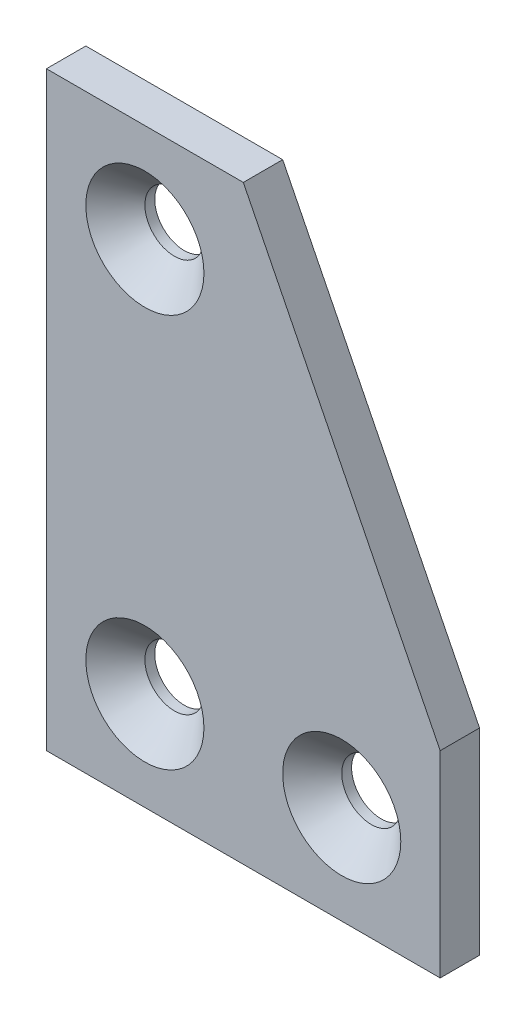
ISO-10303-21;
HEADER;
FILE_DESCRIPTION(('STEP AP214'),'2;1');
FILE_NAME('part.step','',(''),(''),'','','');
FILE_SCHEMA(('AUTOMOTIVE_DESIGN { 1 0 10303 214 1 1 1 1 }'));
ENDSEC;
DATA;
#1=APPLICATION_CONTEXT('core data for automotive mechanical design processes');
#2=APPLICATION_PROTOCOL_DEFINITION('international standard','automotive_design',2000,#1);
#3=PRODUCT_CONTEXT('',#1,'mechanical');
#4=PRODUCT('Part','Part','',(#3));
#5=PRODUCT_RELATED_PRODUCT_CATEGORY('part','',(#4));
#6=PRODUCT_DEFINITION_FORMATION('','',#4);
#7=PRODUCT_DEFINITION_CONTEXT('part definition',#1,'design');
#8=PRODUCT_DEFINITION('design','',#6,#7);
#9=PRODUCT_DEFINITION_SHAPE('','',#8);
#10=(LENGTH_UNIT() NAMED_UNIT(*) SI_UNIT(.MILLI.,.METRE.));
#11=(NAMED_UNIT(*) PLANE_ANGLE_UNIT() SI_UNIT($,.RADIAN.));
#12=(NAMED_UNIT(*) SI_UNIT($,.STERADIAN.) SOLID_ANGLE_UNIT());
#13=UNCERTAINTY_MEASURE_WITH_UNIT(LENGTH_MEASURE(1.E-05),#10,'distance_accuracy_value','');
#14=(GEOMETRIC_REPRESENTATION_CONTEXT(3) GLOBAL_UNCERTAINTY_ASSIGNED_CONTEXT((#13)) GLOBAL_UNIT_ASSIGNED_CONTEXT((#10,
#11,#12)) REPRESENTATION_CONTEXT('',''));
#15=CARTESIAN_POINT('',(0.,0.,0.));
#16=DIRECTION('',(0.,0.,1.));
#17=DIRECTION('',(1.,0.,0.));
#18=AXIS2_PLACEMENT_3D('',#15,#16,#17);
#19=CARTESIAN_POINT('',(0.,30.,2.));
#20=DIRECTION('',(-0.894427190999916,-0.447213595499958,0.));
#21=DIRECTION('',(0.447213595499958,-0.894427190999916,0.));
#22=AXIS2_PLACEMENT_3D('',#19,#20,#21);
#23=PLANE('',#22);
#24=DIRECTION('',(-0.447213595499958,0.894427190999916,0.));
#25=VECTOR('',#24,1.);
#26=CARTESIAN_POINT('',(0.,30.,-2.));
#27=LINE('',#26,#25);
#28=CARTESIAN_POINT('',(20.,-9.99999999999999,-2.));
#29=VERTEX_POINT('',#28);
#30=CARTESIAN_POINT('',(0.,30.,-2.));
#31=VERTEX_POINT('',#30);
#32=EDGE_CURVE('E128',#29,#31,#27,.T.);
#33=ORIENTED_EDGE('',*,*,#32,.T.);
#34=DIRECTION('',(0.,0.,-1.));
#35=VECTOR('',#34,1.);
#36=CARTESIAN_POINT('',(0.,30.,2.));
#37=LINE('',#36,#35);
#38=CARTESIAN_POINT('',(0.,30.,2.));
#39=VERTEX_POINT('',#38);
#40=EDGE_CURVE('E149',#39,#31,#37,.T.);
#41=ORIENTED_EDGE('',*,*,#40,.F.);
#42=DIRECTION('',(-0.447213595499958,0.894427190999916,0.));
#43=VECTOR('',#42,1.);
#44=CARTESIAN_POINT('',(0.,30.,2.));
#45=LINE('',#44,#43);
#46=CARTESIAN_POINT('',(20.,-9.99999999999999,2.));
#47=VERTEX_POINT('',#46);
#48=EDGE_CURVE('E142',#47,#39,#45,.T.);
#49=ORIENTED_EDGE('',*,*,#48,.F.);
#50=DIRECTION('',(0.,0.,-1.));
#51=VECTOR('',#50,1.);
#52=CARTESIAN_POINT('',(20.,-9.99999999999999,2.));
#53=LINE('',#52,#51);
#54=EDGE_CURVE('E124',#47,#29,#53,.T.);
#55=ORIENTED_EDGE('',*,*,#54,.T.);
#56=EDGE_LOOP('',(#33,#41,#49,#55));
#57=FACE_BOUND('',#56,.T.);
#58=ADVANCED_FACE('F45',(#57),#23,.F.);
#59=CARTESIAN_POINT('',(-20.,30.,2.));
#60=DIRECTION('',(0.,-1.,0.));
#61=DIRECTION('',(0.,0.,-1.));
#62=AXIS2_PLACEMENT_3D('',#59,#60,#61);
#63=PLANE('',#62);
#64=DIRECTION('',(-1.,0.,0.));
#65=VECTOR('',#64,1.);
#66=CARTESIAN_POINT('',(-20.,30.,-2.));
#67=LINE('',#66,#65);
#68=CARTESIAN_POINT('',(-20.,30.,-2.));
#69=VERTEX_POINT('',#68);
#70=EDGE_CURVE('E132',#31,#69,#67,.T.);
#71=ORIENTED_EDGE('',*,*,#70,.T.);
#72=DIRECTION('',(0.,0.,-1.));
#73=VECTOR('',#72,1.);
#74=CARTESIAN_POINT('',(-20.,30.,2.));
#75=LINE('',#74,#73);
#76=CARTESIAN_POINT('',(-20.,30.,2.));
#77=VERTEX_POINT('',#76);
#78=EDGE_CURVE('E117',#77,#69,#75,.T.);
#79=ORIENTED_EDGE('',*,*,#78,.F.);
#80=DIRECTION('',(-1.,0.,0.));
#81=VECTOR('',#80,1.);
#82=CARTESIAN_POINT('',(-20.,30.,2.));
#83=LINE('',#82,#81);
#84=EDGE_CURVE('E99',#39,#77,#83,.T.);
#85=ORIENTED_EDGE('',*,*,#84,.F.);
#86=ORIENTED_EDGE('',*,*,#40,.T.);
#87=EDGE_LOOP('',(#71,#79,#85,#86));
#88=FACE_BOUND('',#87,.T.);
#89=ADVANCED_FACE('F189',(#88),#63,.F.);
#90=CARTESIAN_POINT('',(-20.,-30.,2.));
#91=DIRECTION('',(1.,0.,0.));
#92=DIRECTION('',(0.,0.,-1.));
#93=AXIS2_PLACEMENT_3D('',#90,#91,#92);
#94=PLANE('',#93);
#95=DIRECTION('',(0.,-1.,0.));
#96=VECTOR('',#95,1.);
#97=CARTESIAN_POINT('',(-20.,-30.,-2.));
#98=LINE('',#97,#96);
#99=CARTESIAN_POINT('',(-20.,-30.,-2.));
#100=VERTEX_POINT('',#99);
#101=EDGE_CURVE('E115',#69,#100,#98,.T.);
#102=ORIENTED_EDGE('',*,*,#101,.T.);
#103=DIRECTION('',(0.,0.,-1.));
#104=VECTOR('',#103,1.);
#105=CARTESIAN_POINT('',(-20.,-30.,2.));
#106=LINE('',#105,#104);
#107=CARTESIAN_POINT('',(-20.,-30.,2.));
#108=VERTEX_POINT('',#107);
#109=EDGE_CURVE('E112',#108,#100,#106,.T.);
#110=ORIENTED_EDGE('',*,*,#109,.F.);
#111=DIRECTION('',(0.,-1.,0.));
#112=VECTOR('',#111,1.);
#113=CARTESIAN_POINT('',(-20.,-30.,2.));
#114=LINE('',#113,#112);
#115=EDGE_CURVE('E103',#77,#108,#114,.T.);
#116=ORIENTED_EDGE('',*,*,#115,.F.);
#117=ORIENTED_EDGE('',*,*,#78,.T.);
#118=EDGE_LOOP('',(#102,#110,#116,#117));
#119=FACE_BOUND('',#118,.T.);
#120=ADVANCED_FACE('F113',(#119),#94,.F.);
#121=CARTESIAN_POINT('',(-20.,-30.,2.));
#122=DIRECTION('',(0.,1.,0.));
#123=DIRECTION('',(-1.,0.,0.));
#124=AXIS2_PLACEMENT_3D('',#121,#122,#123);
#125=PLANE('',#124);
#126=DIRECTION('',(1.,0.,0.));
#127=VECTOR('',#126,1.);
#128=CARTESIAN_POINT('',(-20.,-30.,-2.));
#129=LINE('',#128,#127);
#130=CARTESIAN_POINT('',(20.,-30.,-2.));
#131=VERTEX_POINT('',#130);
#132=EDGE_CURVE('E84',#100,#131,#129,.T.);
#133=ORIENTED_EDGE('',*,*,#132,.T.);
#134=DIRECTION('',(0.,0.,-1.));
#135=VECTOR('',#134,1.);
#136=CARTESIAN_POINT('',(20.,-30.,2.));
#137=LINE('',#136,#135);
#138=CARTESIAN_POINT('',(20.,-30.,2.));
#139=VERTEX_POINT('',#138);
#140=EDGE_CURVE('E118',#139,#131,#137,.T.);
#141=ORIENTED_EDGE('',*,*,#140,.F.);
#142=DIRECTION('',(1.,0.,0.));
#143=VECTOR('',#142,1.);
#144=CARTESIAN_POINT('',(-20.,-30.,2.));
#145=LINE('',#144,#143);
#146=EDGE_CURVE('E107',#108,#139,#145,.T.);
#147=ORIENTED_EDGE('',*,*,#146,.F.);
#148=ORIENTED_EDGE('',*,*,#109,.T.);
#149=EDGE_LOOP('',(#133,#141,#147,#148));
#150=FACE_BOUND('',#149,.T.);
#151=ADVANCED_FACE('F120',(#150),#125,.F.);
#152=CARTESIAN_POINT('',(20.,-30.,2.));
#153=DIRECTION('',(-1.,0.,0.));
#154=DIRECTION('',(0.,-1.,0.));
#155=AXIS2_PLACEMENT_3D('',#152,#153,#154);
#156=PLANE('',#155);
#157=DIRECTION('',(0.,1.,0.));
#158=VECTOR('',#157,1.);
#159=CARTESIAN_POINT('',(20.,-30.,-2.));
#160=LINE('',#159,#158);
#161=EDGE_CURVE('E90',#131,#29,#160,.T.);
#162=ORIENTED_EDGE('',*,*,#161,.T.);
#163=ORIENTED_EDGE('',*,*,#54,.F.);
#164=DIRECTION('',(0.,1.,0.));
#165=VECTOR('',#164,1.);
#166=CARTESIAN_POINT('',(20.,-30.,2.));
#167=LINE('',#166,#165);
#168=EDGE_CURVE('E64',#139,#47,#167,.T.);
#169=ORIENTED_EDGE('',*,*,#168,.F.);
#170=ORIENTED_EDGE('',*,*,#140,.T.);
#171=EDGE_LOOP('',(#162,#163,#169,#170));
#172=FACE_BOUND('',#171,.T.);
#173=ADVANCED_FACE('F208',(#172),#156,.F.);
#174=CARTESIAN_POINT('',(0.,0.,2.));
#175=DIRECTION('',(0.,0.,1.));
#176=DIRECTION('',(1.,0.,0.));
#177=AXIS2_PLACEMENT_3D('',#174,#175,#176);
#178=PLANE('',#177);
#179=CARTESIAN_POINT('',(10.,-20.,2.));
#180=DIRECTION('',(0.,0.,1.));
#181=DIRECTION('',(1.,0.,0.));
#182=AXIS2_PLACEMENT_3D('',#179,#180,#181);
#183=CIRCLE('',#182,6.);
#184=CARTESIAN_POINT('',(16.,-20.,2.));
#185=VERTEX_POINT('',#184);
#186=EDGE_CURVE('E164',#185,#185,#183,.F.);
#187=ORIENTED_EDGE('',*,*,#186,.T.);
#188=EDGE_LOOP('',(#187));
#189=FACE_BOUND('',#188,.T.);
#190=CARTESIAN_POINT('',(-9.99999999999999,-20.,2.));
#191=DIRECTION('',(0.,0.,1.));
#192=DIRECTION('',(1.,0.,0.));
#193=AXIS2_PLACEMENT_3D('',#190,#191,#192);
#194=CIRCLE('',#193,6.);
#195=CARTESIAN_POINT('',(-4.,-20.,2.));
#196=VERTEX_POINT('',#195);
#197=EDGE_CURVE('E160',#196,#196,#194,.F.);
#198=ORIENTED_EDGE('',*,*,#197,.T.);
#199=EDGE_LOOP('',(#198));
#200=FACE_BOUND('',#199,.T.);
#201=CARTESIAN_POINT('',(-10.,20.,2.));
#202=DIRECTION('',(0.,0.,1.));
#203=DIRECTION('',(1.,0.,0.));
#204=AXIS2_PLACEMENT_3D('',#201,#202,#203);
#205=CIRCLE('',#204,6.00000000000001);
#206=CARTESIAN_POINT('',(-3.99999999999999,20.,2.));
#207=VERTEX_POINT('',#206);
#208=EDGE_CURVE('E156',#207,#207,#205,.F.);
#209=ORIENTED_EDGE('',*,*,#208,.T.);
#210=EDGE_LOOP('',(#209));
#211=FACE_BOUND('',#210,.T.);
#212=ORIENTED_EDGE('',*,*,#48,.T.);
#213=ORIENTED_EDGE('',*,*,#84,.T.);
#214=ORIENTED_EDGE('',*,*,#115,.T.);
#215=ORIENTED_EDGE('',*,*,#146,.T.);
#216=ORIENTED_EDGE('',*,*,#168,.T.);
#217=EDGE_LOOP('',(#212,#213,#214,#215,#216));
#218=FACE_BOUND('',#217,.T.);
#219=ADVANCED_FACE('F105',(#189,#200,#211,#218),#178,.T.);
#220=CARTESIAN_POINT('',(0.,0.,-2.));
#221=DIRECTION('',(0.,0.,1.));
#222=DIRECTION('',(1.,0.,0.));
#223=AXIS2_PLACEMENT_3D('',#220,#221,#222);
#224=PLANE('',#223);
#225=CARTESIAN_POINT('',(-10.,20.,-2.));
#226=DIRECTION('',(0.,0.,1.));
#227=DIRECTION('',(1.,0.,0.));
#228=AXIS2_PLACEMENT_3D('',#225,#226,#227);
#229=CIRCLE('',#228,3.);
#230=CARTESIAN_POINT('',(-7.,20.,-2.));
#231=VERTEX_POINT('',#230);
#232=EDGE_CURVE('E133',#231,#231,#229,.T.);
#233=ORIENTED_EDGE('',*,*,#232,.T.);
#234=EDGE_LOOP('',(#233));
#235=FACE_BOUND('',#234,.T.);
#236=CARTESIAN_POINT('',(-9.99999999999999,-20.,-2.));
#237=DIRECTION('',(0.,0.,1.));
#238=DIRECTION('',(1.,0.,0.));
#239=AXIS2_PLACEMENT_3D('',#236,#237,#238);
#240=CIRCLE('',#239,3.);
#241=CARTESIAN_POINT('',(-7.,-20.,-2.));
#242=VERTEX_POINT('',#241);
#243=EDGE_CURVE('E233',#242,#242,#240,.T.);
#244=ORIENTED_EDGE('',*,*,#243,.T.);
#245=EDGE_LOOP('',(#244));
#246=FACE_BOUND('',#245,.T.);
#247=CARTESIAN_POINT('',(10.,-20.,-2.));
#248=DIRECTION('',(0.,0.,1.));
#249=DIRECTION('',(1.,0.,0.));
#250=AXIS2_PLACEMENT_3D('',#247,#248,#249);
#251=CIRCLE('',#250,3.);
#252=CARTESIAN_POINT('',(13.,-20.,-2.));
#253=VERTEX_POINT('',#252);
#254=EDGE_CURVE('E237',#253,#253,#251,.T.);
#255=ORIENTED_EDGE('',*,*,#254,.T.);
#256=EDGE_LOOP('',(#255));
#257=FACE_BOUND('',#256,.T.);
#258=ORIENTED_EDGE('',*,*,#32,.F.);
#259=ORIENTED_EDGE('',*,*,#161,.F.);
#260=ORIENTED_EDGE('',*,*,#132,.F.);
#261=ORIENTED_EDGE('',*,*,#101,.F.);
#262=ORIENTED_EDGE('',*,*,#70,.F.);
#263=EDGE_LOOP('',(#258,#259,#260,#261,#262));
#264=FACE_BOUND('',#263,.T.);
#265=ADVANCED_FACE('F211',(#235,#246,#257,#264),#224,.F.);
#266=CARTESIAN_POINT('',(10.,-20.,-2.));
#267=DIRECTION('',(0.,0.,1.));
#268=DIRECTION('',(1.,0.,0.));
#269=AXIS2_PLACEMENT_3D('',#266,#267,#268);
#270=CYLINDRICAL_SURFACE('',#269,3.);
#271=CARTESIAN_POINT('',(10.,-20.,-0.999999999999989));
#272=DIRECTION('',(0.,0.,1.));
#273=DIRECTION('',(1.,0.,0.));
#274=AXIS2_PLACEMENT_3D('',#271,#272,#273);
#275=CIRCLE('',#274,3.);
#276=CARTESIAN_POINT('',(13.,-20.,-0.999999999999989));
#277=VERTEX_POINT('',#276);
#278=EDGE_CURVE('E152',#277,#277,#275,.T.);
#279=ORIENTED_EDGE('',*,*,#278,.T.);
#280=EDGE_LOOP('',(#279));
#281=FACE_BOUND('',#280,.T.);
#282=ORIENTED_EDGE('',*,*,#254,.F.);
#283=EDGE_LOOP('',(#282));
#284=FACE_BOUND('',#283,.T.);
#285=ADVANCED_FACE('F214',(#281,#284),#270,.F.);
#286=CARTESIAN_POINT('',(-9.99999999999999,-20.,-2.));
#287=DIRECTION('',(0.,0.,1.));
#288=DIRECTION('',(1.,0.,0.));
#289=AXIS2_PLACEMENT_3D('',#286,#287,#288);
#290=CYLINDRICAL_SURFACE('',#289,3.);
#291=CARTESIAN_POINT('',(-9.99999999999999,-20.,-0.999999999999989));
#292=DIRECTION('',(0.,0.,1.));
#293=DIRECTION('',(1.,0.,0.));
#294=AXIS2_PLACEMENT_3D('',#291,#292,#293);
#295=CIRCLE('',#294,3.);
#296=CARTESIAN_POINT('',(-7.,-20.,-0.999999999999989));
#297=VERTEX_POINT('',#296);
#298=EDGE_CURVE('E56',#297,#297,#295,.T.);
#299=ORIENTED_EDGE('',*,*,#298,.T.);
#300=EDGE_LOOP('',(#299));
#301=FACE_BOUND('',#300,.T.);
#302=ORIENTED_EDGE('',*,*,#243,.F.);
#303=EDGE_LOOP('',(#302));
#304=FACE_BOUND('',#303,.T.);
#305=ADVANCED_FACE('F171',(#301,#304),#290,.F.);
#306=CARTESIAN_POINT('',(-10.,20.,-2.));
#307=DIRECTION('',(0.,0.,1.));
#308=DIRECTION('',(1.,0.,0.));
#309=AXIS2_PLACEMENT_3D('',#306,#307,#308);
#310=CYLINDRICAL_SURFACE('',#309,3.);
#311=CARTESIAN_POINT('',(-10.,20.,-1.00000000000001));
#312=DIRECTION('',(0.,0.,1.));
#313=DIRECTION('',(1.,0.,0.));
#314=AXIS2_PLACEMENT_3D('',#311,#312,#313);
#315=CIRCLE('',#314,3.);
#316=CARTESIAN_POINT('',(-7.,20.,-1.00000000000001));
#317=VERTEX_POINT('',#316);
#318=EDGE_CURVE('E11',#317,#317,#315,.T.);
#319=ORIENTED_EDGE('',*,*,#318,.T.);
#320=EDGE_LOOP('',(#319));
#321=FACE_BOUND('',#320,.T.);
#322=ORIENTED_EDGE('',*,*,#232,.F.);
#323=EDGE_LOOP('',(#322));
#324=FACE_BOUND('',#323,.T.);
#325=ADVANCED_FACE('F183',(#321,#324),#310,.F.);
#326=CARTESIAN_POINT('',(10.,-20.,-0.999999999999989));
#327=DIRECTION('',(0.,0.,1.));
#328=DIRECTION('',(1.,0.,0.));
#329=AXIS2_PLACEMENT_3D('',#326,#327,#328);
#330=CONICAL_SURFACE('',#329,3.,0.78539816339745);
#331=ORIENTED_EDGE('',*,*,#186,.F.);
#332=EDGE_LOOP('',(#331));
#333=FACE_BOUND('',#332,.T.);
#334=ORIENTED_EDGE('',*,*,#278,.F.);
#335=EDGE_LOOP('',(#334));
#336=FACE_BOUND('',#335,.T.);
#337=ADVANCED_FACE('F176',(#333,#336),#330,.F.);
#338=CARTESIAN_POINT('',(-9.99999999999999,-20.,-0.999999999999989));
#339=DIRECTION('',(0.,0.,1.));
#340=DIRECTION('',(1.,0.,0.));
#341=AXIS2_PLACEMENT_3D('',#338,#339,#340);
#342=CONICAL_SURFACE('',#341,3.,0.78539816339745);
#343=ORIENTED_EDGE('',*,*,#197,.F.);
#344=EDGE_LOOP('',(#343));
#345=FACE_BOUND('',#344,.T.);
#346=ORIENTED_EDGE('',*,*,#298,.F.);
#347=EDGE_LOOP('',(#346));
#348=FACE_BOUND('',#347,.T.);
#349=ADVANCED_FACE('F174',(#345,#348),#342,.F.);
#350=CARTESIAN_POINT('',(-10.,20.,-1.00000000000001));
#351=DIRECTION('',(0.,0.,1.));
#352=DIRECTION('',(1.,0.,0.));
#353=AXIS2_PLACEMENT_3D('',#350,#351,#352);
#354=CONICAL_SURFACE('',#353,3.,0.785398163397449);
#355=ORIENTED_EDGE('',*,*,#208,.F.);
#356=EDGE_LOOP('',(#355));
#357=FACE_BOUND('',#356,.T.);
#358=ORIENTED_EDGE('',*,*,#318,.F.);
#359=EDGE_LOOP('',(#358));
#360=FACE_BOUND('',#359,.T.);
#361=ADVANCED_FACE('F48',(#357,#360),#354,.F.);
#362=CLOSED_SHELL('',(#58,#89,#120,#151,#173,#219,#265,#285,#305,#325,#337,#349,#361));
#363=MANIFOLD_SOLID_BREP('B2',#362);
#364=ADVANCED_BREP_SHAPE_REPRESENTATION('',(#18,#363),#14);
#365=SHAPE_DEFINITION_REPRESENTATION(#9,#364);
ENDSEC;
END-ISO-10303-21;
